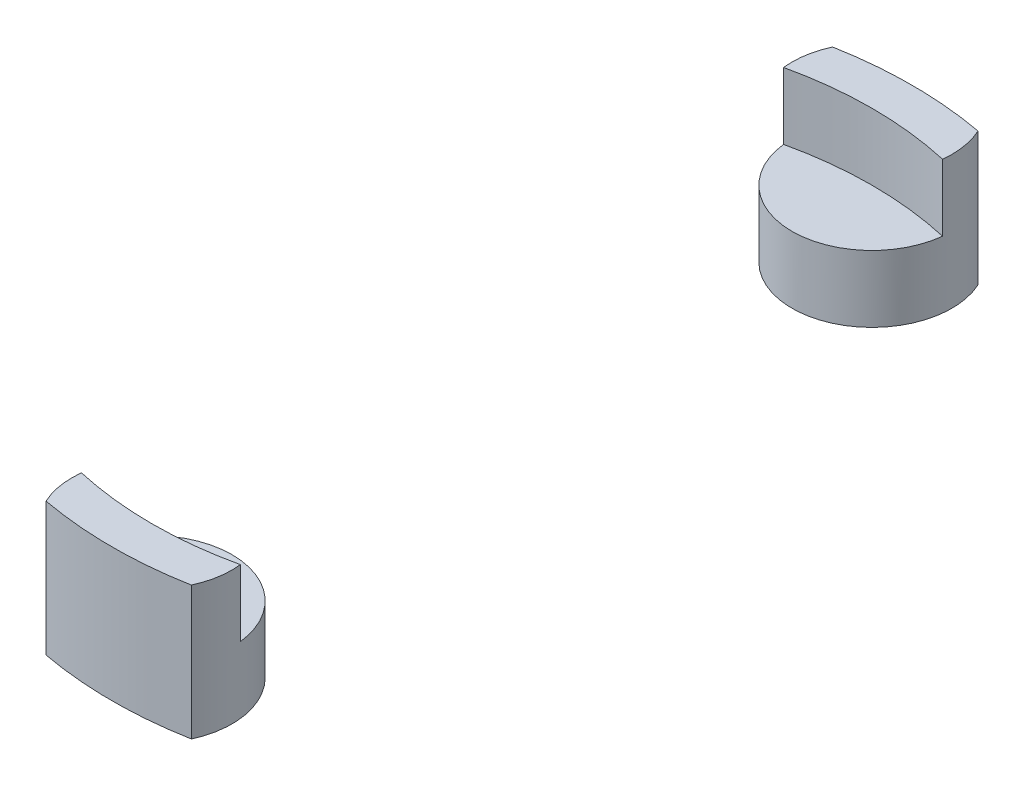
ISO-10303-21;
HEADER;
FILE_DESCRIPTION(('STEP AP214'),'2;1');
FILE_NAME('part.step','',(''),(''),'','','');
FILE_SCHEMA(('AUTOMOTIVE_DESIGN { 1 0 10303 214 1 1 1 1 }'));
ENDSEC;
DATA;
#1=APPLICATION_CONTEXT('core data for automotive mechanical design processes');
#2=APPLICATION_PROTOCOL_DEFINITION('international standard','automotive_design',2000,#1);
#3=PRODUCT_CONTEXT('',#1,'mechanical');
#4=PRODUCT('Part','Part','',(#3));
#5=PRODUCT_RELATED_PRODUCT_CATEGORY('part','',(#4));
#6=PRODUCT_DEFINITION_FORMATION('','',#4);
#7=PRODUCT_DEFINITION_CONTEXT('part definition',#1,'design');
#8=PRODUCT_DEFINITION('design','',#6,#7);
#9=PRODUCT_DEFINITION_SHAPE('','',#8);
#10=(LENGTH_UNIT() NAMED_UNIT(*) SI_UNIT(.MILLI.,.METRE.));
#11=(NAMED_UNIT(*) PLANE_ANGLE_UNIT() SI_UNIT($,.RADIAN.));
#12=(NAMED_UNIT(*) SI_UNIT($,.STERADIAN.) SOLID_ANGLE_UNIT());
#13=UNCERTAINTY_MEASURE_WITH_UNIT(LENGTH_MEASURE(1.E-05),#10,'distance_accuracy_value','');
#14=(GEOMETRIC_REPRESENTATION_CONTEXT(3) GLOBAL_UNCERTAINTY_ASSIGNED_CONTEXT((#13)) GLOBAL_UNIT_ASSIGNED_CONTEXT((#10,
#11,#12)) REPRESENTATION_CONTEXT('',''));
#15=CARTESIAN_POINT('',(0.,0.,0.));
#16=DIRECTION('',(0.,0.,1.));
#17=DIRECTION('',(1.,0.,0.));
#18=AXIS2_PLACEMENT_3D('',#15,#16,#17);
#19=CARTESIAN_POINT('',(0.,5.,0.));
#20=DIRECTION('',(0.,-1.,0.));
#21=DIRECTION('',(0.,0.,-1.));
#22=AXIS2_PLACEMENT_3D('',#19,#20,#21);
#23=CYLINDRICAL_SURFACE('',#22,15.);
#24=CARTESIAN_POINT('',(0.,0.,0.));
#25=DIRECTION('',(0.,1.,0.));
#26=DIRECTION('',(0.,0.,1.));
#27=AXIS2_PLACEMENT_3D('',#24,#25,#26);
#28=CIRCLE('',#27,15.);
#29=CARTESIAN_POINT('',(-2.72717802865893,0.,14.75));
#30=VERTEX_POINT('',#29);
#31=CARTESIAN_POINT('',(2.72717802865893,0.,14.75));
#32=VERTEX_POINT('',#31);
#33=EDGE_CURVE('E125',#30,#32,#28,.T.);
#34=ORIENTED_EDGE('',*,*,#33,.T.);
#35=DIRECTION('',(0.,-1.,0.));
#36=VECTOR('',#35,1.);
#37=CARTESIAN_POINT('',(2.72717802865893,5.,14.75));
#38=LINE('',#37,#36);
#39=CARTESIAN_POINT('',(2.72717802865893,5.,14.75));
#40=VERTEX_POINT('',#39);
#41=EDGE_CURVE('E12',#40,#32,#38,.T.);
#42=ORIENTED_EDGE('',*,*,#41,.F.);
#43=CARTESIAN_POINT('',(0.,5.,0.));
#44=DIRECTION('',(0.,1.,0.));
#45=DIRECTION('',(0.,0.,1.));
#46=AXIS2_PLACEMENT_3D('',#43,#44,#45);
#47=CIRCLE('',#46,15.);
#48=CARTESIAN_POINT('',(-2.72717802865893,5.,14.75));
#49=VERTEX_POINT('',#48);
#50=EDGE_CURVE('E105',#49,#40,#47,.T.);
#51=ORIENTED_EDGE('',*,*,#50,.F.);
#52=DIRECTION('',(0.,-1.,0.));
#53=VECTOR('',#52,1.);
#54=CARTESIAN_POINT('',(-2.72717802865893,5.,14.75));
#55=LINE('',#54,#53);
#56=EDGE_CURVE('E121',#49,#30,#55,.T.);
#57=ORIENTED_EDGE('',*,*,#56,.T.);
#58=EDGE_LOOP('',(#34,#42,#51,#57));
#59=FACE_BOUND('',#58,.T.);
#60=ADVANCED_FACE('F56',(#59),#23,.T.);
#61=CARTESIAN_POINT('',(0.,5.,0.));
#62=DIRECTION('',(0.,-1.,0.));
#63=DIRECTION('',(0.,0.,-1.));
#64=AXIS2_PLACEMENT_3D('',#61,#62,#63);
#65=CYLINDRICAL_SURFACE('',#64,13.5);
#66=CARTESIAN_POINT('',(0.,2.5,0.));
#67=DIRECTION('',(0.,1.,0.));
#68=DIRECTION('',(0.,0.,1.));
#69=AXIS2_PLACEMENT_3D('',#66,#67,#68);
#70=CIRCLE('',#69,13.5);
#71=CARTESIAN_POINT('',(-2.98142396999972,2.5,13.1666666666667));
#72=VERTEX_POINT('',#71);
#73=CARTESIAN_POINT('',(2.98142396999972,2.5,13.1666666666667));
#74=VERTEX_POINT('',#73);
#75=EDGE_CURVE('E93',#72,#74,#70,.T.);
#76=ORIENTED_EDGE('',*,*,#75,.F.);
#77=DIRECTION('',(0.,-1.,0.));
#78=VECTOR('',#77,1.);
#79=CARTESIAN_POINT('',(-2.98142396999972,5.,13.1666666666667));
#80=LINE('',#79,#78);
#81=CARTESIAN_POINT('',(-2.98142396999972,5.,13.1666666666667));
#82=VERTEX_POINT('',#81);
#83=EDGE_CURVE('E116',#82,#72,#80,.T.);
#84=ORIENTED_EDGE('',*,*,#83,.F.);
#85=CARTESIAN_POINT('',(0.,5.,0.));
#86=DIRECTION('',(0.,1.,0.));
#87=DIRECTION('',(0.,0.,1.));
#88=AXIS2_PLACEMENT_3D('',#85,#86,#87);
#89=CIRCLE('',#88,13.5);
#90=CARTESIAN_POINT('',(2.98142396999972,5.,13.1666666666667));
#91=VERTEX_POINT('',#90);
#92=EDGE_CURVE('E103',#82,#91,#89,.T.);
#93=ORIENTED_EDGE('',*,*,#92,.T.);
#94=DIRECTION('',(0.,-1.,0.));
#95=VECTOR('',#94,1.);
#96=CARTESIAN_POINT('',(2.98142396999972,5.,13.1666666666667));
#97=LINE('',#96,#95);
#98=EDGE_CURVE('E65',#91,#74,#97,.T.);
#99=ORIENTED_EDGE('',*,*,#98,.T.);
#100=EDGE_LOOP('',(#76,#84,#93,#99));
#101=FACE_BOUND('',#100,.T.);
#102=ADVANCED_FACE('F117',(#101),#65,.F.);
#103=CARTESIAN_POINT('',(0.,5.,13.5));
#104=DIRECTION('',(0.,-1.,0.));
#105=DIRECTION('',(0.,0.,-1.));
#106=AXIS2_PLACEMENT_3D('',#103,#104,#105);
#107=CYLINDRICAL_SURFACE('',#106,3.);
#108=CARTESIAN_POINT('',(0.,0.,13.5));
#109=DIRECTION('',(0.,1.,0.));
#110=DIRECTION('',(0.,0.,1.));
#111=AXIS2_PLACEMENT_3D('',#108,#109,#110);
#112=CIRCLE('',#111,3.);
#113=EDGE_CURVE('E85',#32,#30,#112,.T.);
#114=ORIENTED_EDGE('',*,*,#113,.T.);
#115=ORIENTED_EDGE('',*,*,#56,.F.);
#116=CARTESIAN_POINT('',(0.,5.,13.5));
#117=DIRECTION('',(0.,1.,0.));
#118=DIRECTION('',(0.,0.,1.));
#119=AXIS2_PLACEMENT_3D('',#116,#117,#118);
#120=CIRCLE('',#119,3.);
#121=EDGE_CURVE('E73',#82,#49,#120,.T.);
#122=ORIENTED_EDGE('',*,*,#121,.F.);
#123=ORIENTED_EDGE('',*,*,#83,.T.);
#124=CARTESIAN_POINT('',(0.,2.5,13.5));
#125=DIRECTION('',(0.,1.,0.));
#126=DIRECTION('',(0.,0.,1.));
#127=AXIS2_PLACEMENT_3D('',#124,#125,#126);
#128=CIRCLE('',#127,3.);
#129=EDGE_CURVE('E113',#74,#72,#128,.T.);
#130=ORIENTED_EDGE('',*,*,#129,.F.);
#131=ORIENTED_EDGE('',*,*,#98,.F.);
#132=CARTESIAN_POINT('',(0.,5.,13.5));
#133=DIRECTION('',(0.,1.,0.));
#134=DIRECTION('',(0.,0.,1.));
#135=AXIS2_PLACEMENT_3D('',#132,#133,#134);
#136=CIRCLE('',#135,3.);
#137=EDGE_CURVE('E99',#40,#91,#136,.T.);
#138=ORIENTED_EDGE('',*,*,#137,.F.);
#139=ORIENTED_EDGE('',*,*,#41,.T.);
#140=EDGE_LOOP('',(#114,#115,#122,#123,#130,#131,#138,#139));
#141=FACE_BOUND('',#140,.T.);
#142=ADVANCED_FACE('F111',(#141),#107,.T.);
#143=CARTESIAN_POINT('',(0.,5.,0.));
#144=DIRECTION('',(0.,1.,0.));
#145=DIRECTION('',(0.,0.,1.));
#146=AXIS2_PLACEMENT_3D('',#143,#144,#145);
#147=PLANE('',#146);
#148=ORIENTED_EDGE('',*,*,#50,.T.);
#149=ORIENTED_EDGE('',*,*,#137,.T.);
#150=ORIENTED_EDGE('',*,*,#92,.F.);
#151=ORIENTED_EDGE('',*,*,#121,.T.);
#152=EDGE_LOOP('',(#148,#149,#150,#151));
#153=FACE_BOUND('',#152,.T.);
#154=ADVANCED_FACE('F101',(#153),#147,.T.);
#155=CARTESIAN_POINT('',(0.,0.,0.));
#156=DIRECTION('',(0.,1.,0.));
#157=DIRECTION('',(0.,0.,1.));
#158=AXIS2_PLACEMENT_3D('',#155,#156,#157);
#159=PLANE('',#158);
#160=ORIENTED_EDGE('',*,*,#33,.F.);
#161=ORIENTED_EDGE('',*,*,#113,.F.);
#162=EDGE_LOOP('',(#160,#161));
#163=FACE_BOUND('',#162,.T.);
#164=ADVANCED_FACE('F143',(#163),#159,.F.);
#165=CARTESIAN_POINT('',(0.,2.5,0.));
#166=DIRECTION('',(0.,1.,0.));
#167=DIRECTION('',(0.,0.,1.));
#168=AXIS2_PLACEMENT_3D('',#165,#166,#167);
#169=PLANE('',#168);
#170=ORIENTED_EDGE('',*,*,#129,.T.);
#171=ORIENTED_EDGE('',*,*,#75,.T.);
#172=EDGE_LOOP('',(#170,#171));
#173=FACE_BOUND('',#172,.T.);
#174=ADVANCED_FACE('F141',(#173),#169,.T.);
#175=CLOSED_SHELL('',(#60,#102,#142,#154,#164,#174));
#176=MANIFOLD_SOLID_BREP('B2',#175);
#177=CARTESIAN_POINT('',(0.,5.,0.));
#178=DIRECTION('',(0.,-1.,0.));
#179=DIRECTION('',(0.,0.,-1.));
#180=AXIS2_PLACEMENT_3D('',#177,#178,#179);
#181=CYLINDRICAL_SURFACE('',#180,13.5);
#182=CARTESIAN_POINT('',(0.,2.5,0.));
#183=DIRECTION('',(0.,1.,0.));
#184=DIRECTION('',(0.,0.,1.));
#185=AXIS2_PLACEMENT_3D('',#182,#183,#184);
#186=CIRCLE('',#185,13.5);
#187=CARTESIAN_POINT('',(2.98142396999972,2.5,-13.1666666666667));
#188=VERTEX_POINT('',#187);
#189=CARTESIAN_POINT('',(-2.98142396999972,2.5,-13.1666666666667));
#190=VERTEX_POINT('',#189);
#191=EDGE_CURVE('E298',#188,#190,#186,.T.);
#192=ORIENTED_EDGE('',*,*,#191,.F.);
#193=DIRECTION('',(0.,-1.,0.));
#194=VECTOR('',#193,1.);
#195=CARTESIAN_POINT('',(2.98142396999972,5.,-13.1666666666667));
#196=LINE('',#195,#194);
#197=CARTESIAN_POINT('',(2.98142396999972,5.,-13.1666666666667));
#198=VERTEX_POINT('',#197);
#199=EDGE_CURVE('E54',#198,#188,#196,.T.);
#200=ORIENTED_EDGE('',*,*,#199,.F.);
#201=CARTESIAN_POINT('',(0.,5.,0.));
#202=DIRECTION('',(0.,1.,0.));
#203=DIRECTION('',(0.,0.,1.));
#204=AXIS2_PLACEMENT_3D('',#201,#202,#203);
#205=CIRCLE('',#204,13.5);
#206=CARTESIAN_POINT('',(-2.98142396999972,5.,-13.1666666666667));
#207=VERTEX_POINT('',#206);
#208=EDGE_CURVE('E263',#198,#207,#205,.T.);
#209=ORIENTED_EDGE('',*,*,#208,.T.);
#210=DIRECTION('',(0.,-1.,0.));
#211=VECTOR('',#210,1.);
#212=CARTESIAN_POINT('',(-2.98142396999972,5.,-13.1666666666667));
#213=LINE('',#212,#211);
#214=EDGE_CURVE('E271',#207,#190,#213,.T.);
#215=ORIENTED_EDGE('',*,*,#214,.T.);
#216=EDGE_LOOP('',(#192,#200,#209,#215));
#217=FACE_BOUND('',#216,.T.);
#218=ADVANCED_FACE('F212',(#217),#181,.F.);
#219=CARTESIAN_POINT('',(0.,5.,0.));
#220=DIRECTION('',(0.,-1.,0.));
#221=DIRECTION('',(0.,0.,-1.));
#222=AXIS2_PLACEMENT_3D('',#219,#220,#221);
#223=CYLINDRICAL_SURFACE('',#222,15.);
#224=CARTESIAN_POINT('',(0.,0.,0.));
#225=DIRECTION('',(0.,1.,0.));
#226=DIRECTION('',(0.,0.,1.));
#227=AXIS2_PLACEMENT_3D('',#224,#225,#226);
#228=CIRCLE('',#227,15.);
#229=CARTESIAN_POINT('',(2.72717802865893,0.,-14.75));
#230=VERTEX_POINT('',#229);
#231=CARTESIAN_POINT('',(-2.72717802865893,0.,-14.75));
#232=VERTEX_POINT('',#231);
#233=EDGE_CURVE('E275',#230,#232,#228,.T.);
#234=ORIENTED_EDGE('',*,*,#233,.T.);
#235=DIRECTION('',(0.,-1.,0.));
#236=VECTOR('',#235,1.);
#237=CARTESIAN_POINT('',(-2.72717802865893,5.,-14.75));
#238=LINE('',#237,#236);
#239=CARTESIAN_POINT('',(-2.72717802865893,5.,-14.75));
#240=VERTEX_POINT('',#239);
#241=EDGE_CURVE('E268',#240,#232,#238,.T.);
#242=ORIENTED_EDGE('',*,*,#241,.F.);
#243=CARTESIAN_POINT('',(0.,5.,0.));
#244=DIRECTION('',(0.,1.,0.));
#245=DIRECTION('',(0.,0.,1.));
#246=AXIS2_PLACEMENT_3D('',#243,#244,#245);
#247=CIRCLE('',#246,15.);
#248=CARTESIAN_POINT('',(2.72717802865893,5.,-14.75));
#249=VERTEX_POINT('',#248);
#250=EDGE_CURVE('E260',#249,#240,#247,.T.);
#251=ORIENTED_EDGE('',*,*,#250,.F.);
#252=DIRECTION('',(0.,-1.,0.));
#253=VECTOR('',#252,1.);
#254=CARTESIAN_POINT('',(2.72717802865893,5.,-14.75));
#255=LINE('',#254,#253);
#256=EDGE_CURVE('E220',#249,#230,#255,.T.);
#257=ORIENTED_EDGE('',*,*,#256,.T.);
#258=EDGE_LOOP('',(#234,#242,#251,#257));
#259=FACE_BOUND('',#258,.T.);
#260=ADVANCED_FACE('F269',(#259),#223,.T.);
#261=CARTESIAN_POINT('',(0.,5.,-13.5));
#262=DIRECTION('',(0.,-1.,0.));
#263=DIRECTION('',(0.,0.,-1.));
#264=AXIS2_PLACEMENT_3D('',#261,#262,#263);
#265=CYLINDRICAL_SURFACE('',#264,3.);
#266=CARTESIAN_POINT('',(0.,0.,-13.5));
#267=DIRECTION('',(0.,1.,0.));
#268=DIRECTION('',(0.,0.,1.));
#269=AXIS2_PLACEMENT_3D('',#266,#267,#268);
#270=CIRCLE('',#269,3.);
#271=EDGE_CURVE('E240',#232,#230,#270,.T.);
#272=ORIENTED_EDGE('',*,*,#271,.T.);
#273=ORIENTED_EDGE('',*,*,#256,.F.);
#274=CARTESIAN_POINT('',(0.,5.,-13.5));
#275=DIRECTION('',(0.,1.,0.));
#276=DIRECTION('',(0.,0.,1.));
#277=AXIS2_PLACEMENT_3D('',#274,#275,#276);
#278=CIRCLE('',#277,3.);
#279=EDGE_CURVE('E257',#198,#249,#278,.T.);
#280=ORIENTED_EDGE('',*,*,#279,.F.);
#281=ORIENTED_EDGE('',*,*,#199,.T.);
#282=CARTESIAN_POINT('',(0.,2.5,-13.5));
#283=DIRECTION('',(0.,1.,0.));
#284=DIRECTION('',(0.,0.,1.));
#285=AXIS2_PLACEMENT_3D('',#282,#283,#284);
#286=CIRCLE('',#285,3.);
#287=EDGE_CURVE('E250',#190,#188,#286,.T.);
#288=ORIENTED_EDGE('',*,*,#287,.F.);
#289=ORIENTED_EDGE('',*,*,#214,.F.);
#290=CARTESIAN_POINT('',(0.,5.,-13.5));
#291=DIRECTION('',(0.,1.,0.));
#292=DIRECTION('',(0.,0.,1.));
#293=AXIS2_PLACEMENT_3D('',#290,#291,#292);
#294=CIRCLE('',#293,3.);
#295=EDGE_CURVE('E228',#240,#207,#294,.T.);
#296=ORIENTED_EDGE('',*,*,#295,.F.);
#297=ORIENTED_EDGE('',*,*,#241,.T.);
#298=EDGE_LOOP('',(#272,#273,#280,#281,#288,#289,#296,#297));
#299=FACE_BOUND('',#298,.T.);
#300=ADVANCED_FACE('F265',(#299),#265,.T.);
#301=CARTESIAN_POINT('',(0.,5.,0.));
#302=DIRECTION('',(0.,1.,0.));
#303=DIRECTION('',(0.,0.,1.));
#304=AXIS2_PLACEMENT_3D('',#301,#302,#303);
#305=PLANE('',#304);
#306=ORIENTED_EDGE('',*,*,#208,.F.);
#307=ORIENTED_EDGE('',*,*,#279,.T.);
#308=ORIENTED_EDGE('',*,*,#250,.T.);
#309=ORIENTED_EDGE('',*,*,#295,.T.);
#310=EDGE_LOOP('',(#306,#307,#308,#309));
#311=FACE_BOUND('',#310,.T.);
#312=ADVANCED_FACE('F258',(#311),#305,.T.);
#313=CARTESIAN_POINT('',(0.,0.,0.));
#314=DIRECTION('',(0.,1.,0.));
#315=DIRECTION('',(0.,0.,1.));
#316=AXIS2_PLACEMENT_3D('',#313,#314,#315);
#317=PLANE('',#316);
#318=ORIENTED_EDGE('',*,*,#233,.F.);
#319=ORIENTED_EDGE('',*,*,#271,.F.);
#320=EDGE_LOOP('',(#318,#319));
#321=FACE_BOUND('',#320,.T.);
#322=ADVANCED_FACE('F281',(#321),#317,.F.);
#323=CARTESIAN_POINT('',(0.,2.5,0.));
#324=DIRECTION('',(0.,1.,0.));
#325=DIRECTION('',(0.,0.,1.));
#326=AXIS2_PLACEMENT_3D('',#323,#324,#325);
#327=PLANE('',#326);
#328=ORIENTED_EDGE('',*,*,#191,.T.);
#329=ORIENTED_EDGE('',*,*,#287,.T.);
#330=EDGE_LOOP('',(#328,#329));
#331=FACE_BOUND('',#330,.T.);
#332=ADVANCED_FACE('F283',(#331),#327,.T.);
#333=CLOSED_SHELL('',(#218,#260,#300,#312,#322,#332));
#334=MANIFOLD_SOLID_BREP('B6',#333);
#335=ADVANCED_BREP_SHAPE_REPRESENTATION('',(#18,#176,#334),#14);
#336=SHAPE_DEFINITION_REPRESENTATION(#9,#335);
ENDSEC;
END-ISO-10303-21;
